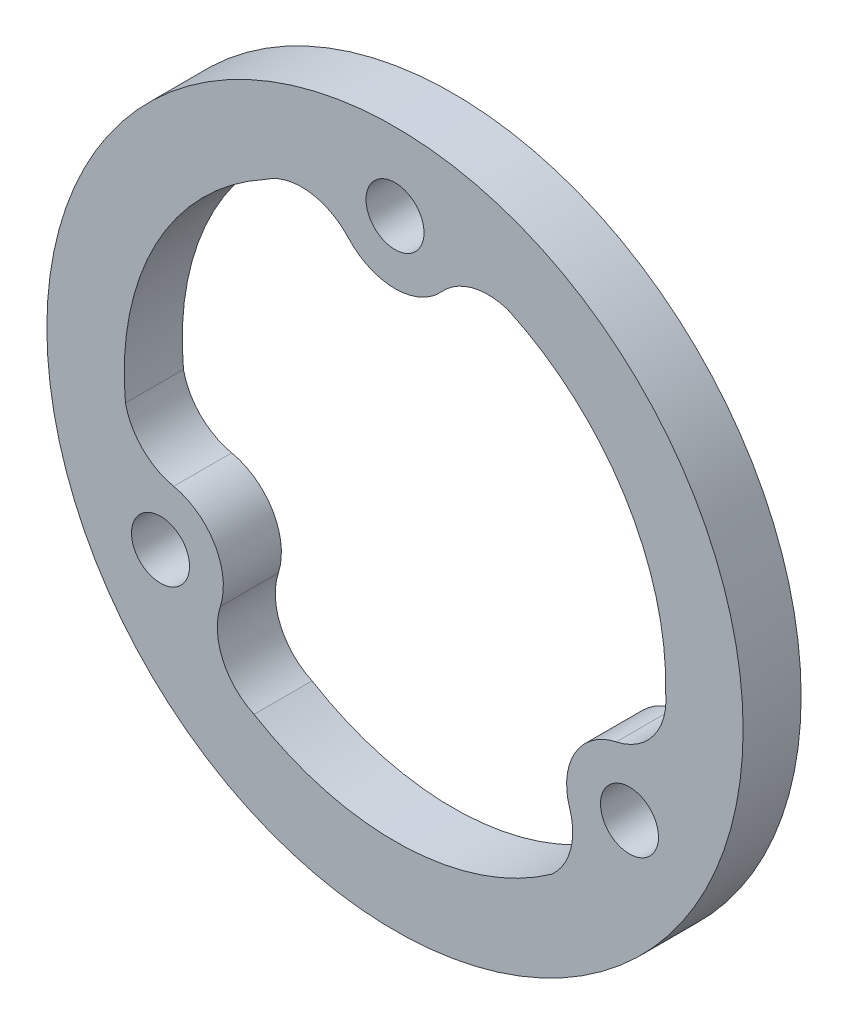
ISO-10303-21;
HEADER;
FILE_DESCRIPTION(('STEP AP214'),'2;1');
FILE_NAME('part.step','',(''),(''),'','','');
FILE_SCHEMA(('AUTOMOTIVE_DESIGN { 1 0 10303 214 1 1 1 1 }'));
ENDSEC;
DATA;
#1=APPLICATION_CONTEXT('core data for automotive mechanical design processes');
#2=APPLICATION_PROTOCOL_DEFINITION('international standard','automotive_design',2000,#1);
#3=PRODUCT_CONTEXT('',#1,'mechanical');
#4=PRODUCT('Part','Part','',(#3));
#5=PRODUCT_RELATED_PRODUCT_CATEGORY('part','',(#4));
#6=PRODUCT_DEFINITION_FORMATION('','',#4);
#7=PRODUCT_DEFINITION_CONTEXT('part definition',#1,'design');
#8=PRODUCT_DEFINITION('design','',#6,#7);
#9=PRODUCT_DEFINITION_SHAPE('','',#8);
#10=(LENGTH_UNIT() NAMED_UNIT(*) SI_UNIT(.MILLI.,.METRE.));
#11=(NAMED_UNIT(*) PLANE_ANGLE_UNIT() SI_UNIT($,.RADIAN.));
#12=(NAMED_UNIT(*) SI_UNIT($,.STERADIAN.) SOLID_ANGLE_UNIT());
#13=UNCERTAINTY_MEASURE_WITH_UNIT(LENGTH_MEASURE(1.E-05),#10,'distance_accuracy_value','');
#14=(GEOMETRIC_REPRESENTATION_CONTEXT(3) GLOBAL_UNCERTAINTY_ASSIGNED_CONTEXT((#13)) GLOBAL_UNIT_ASSIGNED_CONTEXT((#10,
#11,#12)) REPRESENTATION_CONTEXT('',''));
#15=CARTESIAN_POINT('',(0.,0.,0.));
#16=DIRECTION('',(0.,0.,1.));
#17=DIRECTION('',(1.,0.,0.));
#18=AXIS2_PLACEMENT_3D('',#15,#16,#17);
#19=CARTESIAN_POINT('',(0.,0.,3.));
#20=DIRECTION('',(0.,0.,1.));
#21=DIRECTION('',(1.,0.,0.));
#22=AXIS2_PLACEMENT_3D('',#19,#20,#21);
#23=PLANE('',#22);
#24=CARTESIAN_POINT('',(0.,0.,3.));
#25=DIRECTION('',(0.,0.,1.));
#26=DIRECTION('',(1.,0.,0.));
#27=AXIS2_PLACEMENT_3D('',#24,#25,#26);
#28=CIRCLE('',#27,14.);
#29=CARTESIAN_POINT('',(13.9959775932849,-0.335575935174573,3.));
#30=VERTEX_POINT('',#29);
#31=CARTESIAN_POINT('',(5.80943087987062,12.7377593340432,3.));
#32=VERTEX_POINT('',#31);
#33=EDGE_CURVE('E130',#30,#32,#28,.T.);
#34=ORIENTED_EDGE('',*,*,#33,.F.);
#35=CARTESIAN_POINT('',(10.7607074751454,-0.644650784804921,3.));
#36=DIRECTION('',(0.,0.,1.));
#37=DIRECTION('',(1.,0.,0.));
#38=AXIS2_PLACEMENT_3D('',#35,#36,#37);
#39=CIRCLE('',#38,3.25);
#40=CARTESIAN_POINT('',(11.4425315640637,-3.82232539240255,3.));
#41=VERTEX_POINT('',#40);
#42=EDGE_CURVE('E122',#41,#30,#39,.T.);
#43=ORIENTED_EDGE('',*,*,#42,.F.);
#44=CARTESIAN_POINT('',(12.124355652982,-7.00000000000017,3.));
#45=DIRECTION('',(0.,0.,-1.));
#46=DIRECTION('',(1.,0.,0.));
#47=AXIS2_PLACEMENT_3D('',#44,#45,#46);
#48=CIRCLE('',#47,3.25);
#49=CARTESIAN_POINT('',(9.03149667338257,-7.99836032188346,3.));
#50=VERTEX_POINT('',#49);
#51=EDGE_CURVE('E165',#50,#41,#48,.T.);
#52=ORIENTED_EDGE('',*,*,#51,.F.);
#53=CARTESIAN_POINT('',(5.93863769378309,-8.99672064376674,3.));
#54=DIRECTION('',(0.,0.,1.));
#55=DIRECTION('',(1.,0.,0.));
#56=AXIS2_PLACEMENT_3D('',#53,#54,#55);
#57=CIRCLE('',#56,3.25);
#58=CARTESIAN_POINT('',(8.12650773063849,-11.3999943905194,3.));
#59=VERTEX_POINT('',#58);
#60=EDGE_CURVE('E163',#59,#50,#57,.T.);
#61=ORIENTED_EDGE('',*,*,#60,.F.);
#62=CARTESIAN_POINT('',(0.,0.,3.));
#63=DIRECTION('',(0.,0.,1.));
#64=DIRECTION('',(1.,0.,0.));
#65=AXIS2_PLACEMENT_3D('',#62,#63,#64);
#66=CIRCLE('',#65,14.);
#67=CARTESIAN_POINT('',(-7.28860608140232,-11.9530841789952,3.));
#68=VERTEX_POINT('',#67);
#69=EDGE_CURVE('E161',#68,#59,#66,.T.);
#70=ORIENTED_EDGE('',*,*,#69,.F.);
#71=CARTESIAN_POINT('',(-5.93863769378334,-8.99672064376658,3.));
#72=DIRECTION('',(0.,0.,1.));
#73=DIRECTION('',(1.,0.,0.));
#74=AXIS2_PLACEMENT_3D('',#71,#72,#73);
#75=CIRCLE('',#74,3.25);
#76=CARTESIAN_POINT('',(-9.03149667338279,-7.9983603218832,3.));
#77=VERTEX_POINT('',#76);
#78=EDGE_CURVE('E159',#77,#68,#75,.T.);
#79=ORIENTED_EDGE('',*,*,#78,.F.);
#80=CARTESIAN_POINT('',(-12.1243556529822,-6.99999999999983,3.));
#81=DIRECTION('',(0.,0.,-1.));
#82=DIRECTION('',(1.,0.,0.));
#83=AXIS2_PLACEMENT_3D('',#80,#81,#82);
#84=CIRCLE('',#83,3.25);
#85=CARTESIAN_POINT('',(-11.4425315640638,-3.82232539240223,3.));
#86=VERTEX_POINT('',#85);
#87=EDGE_CURVE('E157',#86,#77,#84,.T.);
#88=ORIENTED_EDGE('',*,*,#87,.F.);
#89=CARTESIAN_POINT('',(-10.7607074751454,-0.644650784804622,3.));
#90=DIRECTION('',(0.,0.,1.));
#91=DIRECTION('',(1.,0.,0.));
#92=AXIS2_PLACEMENT_3D('',#89,#90,#91);
#93=CIRCLE('',#92,3.25);
#94=CARTESIAN_POINT('',(-13.9359386105091,-1.33776494352389,3.));
#95=VERTEX_POINT('',#94);
#96=EDGE_CURVE('E155',#95,#86,#93,.T.);
#97=ORIENTED_EDGE('',*,*,#96,.F.);
#98=CARTESIAN_POINT('',(0.,0.,3.));
#99=DIRECTION('',(0.,0.,1.));
#100=DIRECTION('',(1.,0.,0.));
#101=AXIS2_PLACEMENT_3D('',#98,#99,#100);
#102=CIRCLE('',#101,14.);
#103=CARTESIAN_POINT('',(-6.70737151188253,12.2886601141698,3.));
#104=VERTEX_POINT('',#103);
#105=EDGE_CURVE('E153',#104,#95,#102,.T.);
#106=ORIENTED_EDGE('',*,*,#105,.F.);
#107=CARTESIAN_POINT('',(-4.82206978136206,9.6413714285715,3.));
#108=DIRECTION('',(0.,0.,1.));
#109=DIRECTION('',(1.,0.,0.));
#110=AXIS2_PLACEMENT_3D('',#107,#108,#109);
#111=CIRCLE('',#110,3.25);
#112=CARTESIAN_POINT('',(-2.41103489068093,11.8206857142857,3.));
#113=VERTEX_POINT('',#112);
#114=EDGE_CURVE('E151',#113,#104,#111,.T.);
#115=ORIENTED_EDGE('',*,*,#114,.F.);
#116=CARTESIAN_POINT('',(2.01308400075598E-13,14.,3.));
#117=DIRECTION('',(0.,0.,-1.));
#118=DIRECTION('',(1.,0.,0.));
#119=AXIS2_PLACEMENT_3D('',#116,#117,#118);
#120=CIRCLE('',#119,3.25);
#121=CARTESIAN_POINT('',(2.41103489068127,11.8206857142857,3.));
#122=VERTEX_POINT('',#121);
#123=EDGE_CURVE('E146',#122,#113,#120,.T.);
#124=ORIENTED_EDGE('',*,*,#123,.F.);
#125=CARTESIAN_POINT('',(4.82206978136234,9.64137142857136,3.));
#126=DIRECTION('',(0.,0.,1.));
#127=DIRECTION('',(1.,0.,0.));
#128=AXIS2_PLACEMENT_3D('',#125,#126,#127);
#129=CIRCLE('',#128,3.25);
#130=EDGE_CURVE('E144',#32,#122,#129,.T.);
#131=ORIENTED_EDGE('',*,*,#130,.F.);
#132=EDGE_LOOP('',(#34,#43,#52,#61,#70,#79,#88,#97,#106,#115,#124,#131));
#133=FACE_BOUND('',#132,.T.);
#134=CARTESIAN_POINT('',(12.124355652982,-7.00000000000017,3.));
#135=DIRECTION('',(0.,0.,1.));
#136=DIRECTION('',(1.,0.,0.));
#137=AXIS2_PLACEMENT_3D('',#134,#135,#136);
#138=CIRCLE('',#137,1.50000000000007);
#139=CARTESIAN_POINT('',(13.6243556529821,-7.00000000000017,3.));
#140=VERTEX_POINT('',#139);
#141=EDGE_CURVE('E218',#140,#140,#138,.T.);
#142=ORIENTED_EDGE('',*,*,#141,.F.);
#143=EDGE_LOOP('',(#142));
#144=FACE_BOUND('',#143,.T.);
#145=CARTESIAN_POINT('',(0.,0.,3.));
#146=DIRECTION('',(0.,0.,1.));
#147=DIRECTION('',(1.,0.,0.));
#148=AXIS2_PLACEMENT_3D('',#145,#146,#147);
#149=CIRCLE('',#148,18.);
#150=CARTESIAN_POINT('',(18.,0.,3.));
#151=VERTEX_POINT('',#150);
#152=EDGE_CURVE('E11',#151,#151,#149,.T.);
#153=ORIENTED_EDGE('',*,*,#152,.T.);
#154=EDGE_LOOP('',(#153));
#155=FACE_BOUND('',#154,.T.);
#156=CARTESIAN_POINT('',(2.01308400075598E-13,14.,3.));
#157=DIRECTION('',(0.,0.,1.));
#158=DIRECTION('',(1.,0.,0.));
#159=AXIS2_PLACEMENT_3D('',#156,#157,#158);
#160=CIRCLE('',#159,1.5);
#161=CARTESIAN_POINT('',(1.5000000000002,14.,3.));
#162=VERTEX_POINT('',#161);
#163=EDGE_CURVE('E224',#162,#162,#160,.T.);
#164=ORIENTED_EDGE('',*,*,#163,.F.);
#165=EDGE_LOOP('',(#164));
#166=FACE_BOUND('',#165,.T.);
#167=CARTESIAN_POINT('',(-12.1243556529822,-6.99999999999983,3.));
#168=DIRECTION('',(0.,0.,1.));
#169=DIRECTION('',(1.,0.,0.));
#170=AXIS2_PLACEMENT_3D('',#167,#168,#169);
#171=CIRCLE('',#170,1.5);
#172=CARTESIAN_POINT('',(-10.6243556529822,-6.99999999999983,3.));
#173=VERTEX_POINT('',#172);
#174=EDGE_CURVE('E168',#173,#173,#171,.T.);
#175=ORIENTED_EDGE('',*,*,#174,.F.);
#176=EDGE_LOOP('',(#175));
#177=FACE_BOUND('',#176,.T.);
#178=ADVANCED_FACE('F33',(#133,#144,#155,#166,#177),#23,.T.);
#179=CARTESIAN_POINT('',(0.,0.,0.));
#180=DIRECTION('',(0.,0.,1.));
#181=DIRECTION('',(1.,0.,0.));
#182=AXIS2_PLACEMENT_3D('',#179,#180,#181);
#183=PLANE('',#182);
#184=CARTESIAN_POINT('',(12.124355652982,-7.00000000000017,0.));
#185=DIRECTION('',(0.,0.,1.));
#186=DIRECTION('',(1.,0.,0.));
#187=AXIS2_PLACEMENT_3D('',#184,#185,#186);
#188=CIRCLE('',#187,1.50000000000007);
#189=CARTESIAN_POINT('',(13.6243556529821,-7.00000000000017,0.));
#190=VERTEX_POINT('',#189);
#191=EDGE_CURVE('E138',#190,#190,#188,.T.);
#192=ORIENTED_EDGE('',*,*,#191,.T.);
#193=EDGE_LOOP('',(#192));
#194=FACE_BOUND('',#193,.T.);
#195=CARTESIAN_POINT('',(2.01308400075598E-13,14.,0.));
#196=DIRECTION('',(0.,0.,1.));
#197=DIRECTION('',(1.,0.,0.));
#198=AXIS2_PLACEMENT_3D('',#195,#196,#197);
#199=CIRCLE('',#198,1.5);
#200=CARTESIAN_POINT('',(1.5000000000002,14.,0.));
#201=VERTEX_POINT('',#200);
#202=EDGE_CURVE('E221',#201,#201,#199,.T.);
#203=ORIENTED_EDGE('',*,*,#202,.T.);
#204=EDGE_LOOP('',(#203));
#205=FACE_BOUND('',#204,.T.);
#206=CARTESIAN_POINT('',(0.,0.,0.));
#207=DIRECTION('',(0.,0.,1.));
#208=DIRECTION('',(1.,0.,0.));
#209=AXIS2_PLACEMENT_3D('',#206,#207,#208);
#210=CIRCLE('',#209,18.);
#211=CARTESIAN_POINT('',(18.,0.,0.));
#212=VERTEX_POINT('',#211);
#213=EDGE_CURVE('E37',#212,#212,#210,.T.);
#214=ORIENTED_EDGE('',*,*,#213,.F.);
#215=EDGE_LOOP('',(#214));
#216=FACE_BOUND('',#215,.T.);
#217=CARTESIAN_POINT('',(10.7607074751454,-0.644650784804921,0.));
#218=DIRECTION('',(0.,0.,1.));
#219=DIRECTION('',(1.,0.,0.));
#220=AXIS2_PLACEMENT_3D('',#217,#218,#219);
#221=CIRCLE('',#220,3.25);
#222=CARTESIAN_POINT('',(11.4425315640637,-3.82232539240255,0.));
#223=VERTEX_POINT('',#222);
#224=CARTESIAN_POINT('',(13.9959775932849,-0.335575935174573,0.));
#225=VERTEX_POINT('',#224);
#226=EDGE_CURVE('E56',#223,#225,#221,.T.);
#227=ORIENTED_EDGE('',*,*,#226,.T.);
#228=CARTESIAN_POINT('',(0.,0.,0.));
#229=DIRECTION('',(0.,0.,1.));
#230=DIRECTION('',(1.,0.,0.));
#231=AXIS2_PLACEMENT_3D('',#228,#229,#230);
#232=CIRCLE('',#231,14.);
#233=CARTESIAN_POINT('',(5.80943087987062,12.7377593340432,0.));
#234=VERTEX_POINT('',#233);
#235=EDGE_CURVE('E137',#225,#234,#232,.T.);
#236=ORIENTED_EDGE('',*,*,#235,.T.);
#237=CARTESIAN_POINT('',(4.82206978136234,9.64137142857136,0.));
#238=DIRECTION('',(0.,0.,1.));
#239=DIRECTION('',(1.,0.,0.));
#240=AXIS2_PLACEMENT_3D('',#237,#238,#239);
#241=CIRCLE('',#240,3.25);
#242=CARTESIAN_POINT('',(2.41103489068127,11.8206857142857,0.));
#243=VERTEX_POINT('',#242);
#244=EDGE_CURVE('E170',#234,#243,#241,.T.);
#245=ORIENTED_EDGE('',*,*,#244,.T.);
#246=CARTESIAN_POINT('',(2.01308400075598E-13,14.,0.));
#247=DIRECTION('',(0.,0.,-1.));
#248=DIRECTION('',(1.,0.,0.));
#249=AXIS2_PLACEMENT_3D('',#246,#247,#248);
#250=CIRCLE('',#249,3.25);
#251=CARTESIAN_POINT('',(-2.41103489068093,11.8206857142857,0.));
#252=VERTEX_POINT('',#251);
#253=EDGE_CURVE('E173',#243,#252,#250,.T.);
#254=ORIENTED_EDGE('',*,*,#253,.T.);
#255=CARTESIAN_POINT('',(-4.82206978136206,9.6413714285715,0.));
#256=DIRECTION('',(0.,0.,1.));
#257=DIRECTION('',(1.,0.,0.));
#258=AXIS2_PLACEMENT_3D('',#255,#256,#257);
#259=CIRCLE('',#258,3.25);
#260=CARTESIAN_POINT('',(-6.70737151188253,12.2886601141698,0.));
#261=VERTEX_POINT('',#260);
#262=EDGE_CURVE('E176',#252,#261,#259,.T.);
#263=ORIENTED_EDGE('',*,*,#262,.T.);
#264=CARTESIAN_POINT('',(0.,0.,0.));
#265=DIRECTION('',(0.,0.,1.));
#266=DIRECTION('',(1.,0.,0.));
#267=AXIS2_PLACEMENT_3D('',#264,#265,#266);
#268=CIRCLE('',#267,14.);
#269=CARTESIAN_POINT('',(-13.9359386105091,-1.33776494352389,0.));
#270=VERTEX_POINT('',#269);
#271=EDGE_CURVE('E179',#261,#270,#268,.T.);
#272=ORIENTED_EDGE('',*,*,#271,.T.);
#273=CARTESIAN_POINT('',(-10.7607074751454,-0.644650784804622,0.));
#274=DIRECTION('',(0.,0.,1.));
#275=DIRECTION('',(1.,0.,0.));
#276=AXIS2_PLACEMENT_3D('',#273,#274,#275);
#277=CIRCLE('',#276,3.25);
#278=CARTESIAN_POINT('',(-11.4425315640638,-3.82232539240223,0.));
#279=VERTEX_POINT('',#278);
#280=EDGE_CURVE('E182',#270,#279,#277,.T.);
#281=ORIENTED_EDGE('',*,*,#280,.T.);
#282=CARTESIAN_POINT('',(-12.1243556529822,-6.99999999999983,0.));
#283=DIRECTION('',(0.,0.,-1.));
#284=DIRECTION('',(1.,0.,0.));
#285=AXIS2_PLACEMENT_3D('',#282,#283,#284);
#286=CIRCLE('',#285,3.25);
#287=CARTESIAN_POINT('',(-9.03149667338279,-7.9983603218832,0.));
#288=VERTEX_POINT('',#287);
#289=EDGE_CURVE('E185',#279,#288,#286,.T.);
#290=ORIENTED_EDGE('',*,*,#289,.T.);
#291=CARTESIAN_POINT('',(-5.93863769378334,-8.99672064376658,0.));
#292=DIRECTION('',(0.,0.,1.));
#293=DIRECTION('',(1.,0.,0.));
#294=AXIS2_PLACEMENT_3D('',#291,#292,#293);
#295=CIRCLE('',#294,3.25);
#296=CARTESIAN_POINT('',(-7.28860608140232,-11.9530841789952,0.));
#297=VERTEX_POINT('',#296);
#298=EDGE_CURVE('E188',#288,#297,#295,.T.);
#299=ORIENTED_EDGE('',*,*,#298,.T.);
#300=CARTESIAN_POINT('',(0.,0.,0.));
#301=DIRECTION('',(0.,0.,1.));
#302=DIRECTION('',(1.,0.,0.));
#303=AXIS2_PLACEMENT_3D('',#300,#301,#302);
#304=CIRCLE('',#303,14.);
#305=CARTESIAN_POINT('',(8.12650773063849,-11.3999943905194,0.));
#306=VERTEX_POINT('',#305);
#307=EDGE_CURVE('E191',#297,#306,#304,.T.);
#308=ORIENTED_EDGE('',*,*,#307,.T.);
#309=CARTESIAN_POINT('',(5.93863769378309,-8.99672064376674,0.));
#310=DIRECTION('',(0.,0.,1.));
#311=DIRECTION('',(1.,0.,0.));
#312=AXIS2_PLACEMENT_3D('',#309,#310,#311);
#313=CIRCLE('',#312,3.25);
#314=CARTESIAN_POINT('',(9.03149667338257,-7.99836032188346,0.));
#315=VERTEX_POINT('',#314);
#316=EDGE_CURVE('E194',#306,#315,#313,.T.);
#317=ORIENTED_EDGE('',*,*,#316,.T.);
#318=CARTESIAN_POINT('',(12.124355652982,-7.00000000000017,0.));
#319=DIRECTION('',(0.,0.,-1.));
#320=DIRECTION('',(1.,0.,0.));
#321=AXIS2_PLACEMENT_3D('',#318,#319,#320);
#322=CIRCLE('',#321,3.25);
#323=EDGE_CURVE('E131',#315,#223,#322,.T.);
#324=ORIENTED_EDGE('',*,*,#323,.T.);
#325=EDGE_LOOP('',(#227,#236,#245,#254,#263,#272,#281,#290,#299,#308,#317,#324));
#326=FACE_BOUND('',#325,.T.);
#327=CARTESIAN_POINT('',(-12.1243556529822,-6.99999999999983,0.));
#328=DIRECTION('',(0.,0.,1.));
#329=DIRECTION('',(1.,0.,0.));
#330=AXIS2_PLACEMENT_3D('',#327,#328,#329);
#331=CIRCLE('',#330,1.5);
#332=CARTESIAN_POINT('',(-10.6243556529822,-6.99999999999983,0.));
#333=VERTEX_POINT('',#332);
#334=EDGE_CURVE('E403',#333,#333,#331,.T.);
#335=ORIENTED_EDGE('',*,*,#334,.T.);
#336=EDGE_LOOP('',(#335));
#337=FACE_BOUND('',#336,.T.);
#338=ADVANCED_FACE('F230',(#194,#205,#216,#326,#337),#183,.F.);
#339=CARTESIAN_POINT('',(0.,0.,3.));
#340=DIRECTION('',(0.,0.,-1.));
#341=DIRECTION('',(-1.,0.,0.));
#342=AXIS2_PLACEMENT_3D('',#339,#340,#341);
#343=CYLINDRICAL_SURFACE('',#342,18.);
#344=ORIENTED_EDGE('',*,*,#152,.F.);
#345=EDGE_LOOP('',(#344));
#346=FACE_BOUND('',#345,.T.);
#347=ORIENTED_EDGE('',*,*,#213,.T.);
#348=EDGE_LOOP('',(#347));
#349=FACE_BOUND('',#348,.T.);
#350=ADVANCED_FACE('F35',(#346,#349),#343,.T.);
#351=CARTESIAN_POINT('',(2.01308400075598E-13,14.,3.));
#352=DIRECTION('',(0.,0.,-1.));
#353=DIRECTION('',(-1.,0.,0.));
#354=AXIS2_PLACEMENT_3D('',#351,#352,#353);
#355=CYLINDRICAL_SURFACE('',#354,1.5);
#356=ORIENTED_EDGE('',*,*,#163,.T.);
#357=EDGE_LOOP('',(#356));
#358=FACE_BOUND('',#357,.T.);
#359=ORIENTED_EDGE('',*,*,#202,.F.);
#360=EDGE_LOOP('',(#359));
#361=FACE_BOUND('',#360,.T.);
#362=ADVANCED_FACE('F233',(#358,#361),#355,.F.);
#363=CARTESIAN_POINT('',(12.124355652982,-7.00000000000017,3.));
#364=DIRECTION('',(0.,0.,-1.));
#365=DIRECTION('',(-1.,0.,0.));
#366=AXIS2_PLACEMENT_3D('',#363,#364,#365);
#367=CYLINDRICAL_SURFACE('',#366,1.50000000000007);
#368=ORIENTED_EDGE('',*,*,#141,.T.);
#369=EDGE_LOOP('',(#368));
#370=FACE_BOUND('',#369,.T.);
#371=ORIENTED_EDGE('',*,*,#191,.F.);
#372=EDGE_LOOP('',(#371));
#373=FACE_BOUND('',#372,.T.);
#374=ADVANCED_FACE('F235',(#370,#373),#367,.F.);
#375=CARTESIAN_POINT('',(10.7607074751454,-0.644650784804921,3.));
#376=DIRECTION('',(0.,0.,-1.));
#377=DIRECTION('',(-1.,0.,0.));
#378=AXIS2_PLACEMENT_3D('',#375,#376,#377);
#379=CYLINDRICAL_SURFACE('',#378,3.25);
#380=ORIENTED_EDGE('',*,*,#226,.F.);
#381=DIRECTION('',(0.,0.,-1.));
#382=VECTOR('',#381,1.);
#383=CARTESIAN_POINT('',(11.4425315640637,-3.82232539240255,3.));
#384=LINE('',#383,#382);
#385=EDGE_CURVE('E126',#41,#223,#384,.T.);
#386=ORIENTED_EDGE('',*,*,#385,.F.);
#387=ORIENTED_EDGE('',*,*,#42,.T.);
#388=DIRECTION('',(0.,0.,-1.));
#389=VECTOR('',#388,1.);
#390=CARTESIAN_POINT('',(13.9959775932849,-0.335575935174573,3.));
#391=LINE('',#390,#389);
#392=EDGE_CURVE('E125',#30,#225,#391,.T.);
#393=ORIENTED_EDGE('',*,*,#392,.T.);
#394=EDGE_LOOP('',(#380,#386,#387,#393));
#395=FACE_BOUND('',#394,.T.);
#396=ADVANCED_FACE('F124',(#395),#379,.F.);
#397=CARTESIAN_POINT('',(0.,0.,3.));
#398=DIRECTION('',(0.,0.,-1.));
#399=DIRECTION('',(-1.,0.,0.));
#400=AXIS2_PLACEMENT_3D('',#397,#398,#399);
#401=CYLINDRICAL_SURFACE('',#400,14.);
#402=ORIENTED_EDGE('',*,*,#235,.F.);
#403=ORIENTED_EDGE('',*,*,#392,.F.);
#404=ORIENTED_EDGE('',*,*,#33,.T.);
#405=DIRECTION('',(0.,0.,-1.));
#406=VECTOR('',#405,1.);
#407=CARTESIAN_POINT('',(5.80943087987062,12.7377593340432,3.));
#408=LINE('',#407,#406);
#409=EDGE_CURVE('E139',#32,#234,#408,.T.);
#410=ORIENTED_EDGE('',*,*,#409,.T.);
#411=EDGE_LOOP('',(#402,#403,#404,#410));
#412=FACE_BOUND('',#411,.T.);
#413=ADVANCED_FACE('F134',(#412),#401,.F.);
#414=CARTESIAN_POINT('',(4.82206978136234,9.64137142857136,3.));
#415=DIRECTION('',(0.,0.,-1.));
#416=DIRECTION('',(-1.,0.,0.));
#417=AXIS2_PLACEMENT_3D('',#414,#415,#416);
#418=CYLINDRICAL_SURFACE('',#417,3.25);
#419=ORIENTED_EDGE('',*,*,#244,.F.);
#420=ORIENTED_EDGE('',*,*,#409,.F.);
#421=ORIENTED_EDGE('',*,*,#130,.T.);
#422=DIRECTION('',(0.,0.,-1.));
#423=VECTOR('',#422,1.);
#424=CARTESIAN_POINT('',(2.41103489068127,11.8206857142857,3.));
#425=LINE('',#424,#423);
#426=EDGE_CURVE('E215',#122,#243,#425,.T.);
#427=ORIENTED_EDGE('',*,*,#426,.T.);
#428=EDGE_LOOP('',(#419,#420,#421,#427));
#429=FACE_BOUND('',#428,.T.);
#430=ADVANCED_FACE('F286',(#429),#418,.F.);
#431=CARTESIAN_POINT('',(2.01308400075598E-13,14.,3.));
#432=DIRECTION('',(0.,0.,-1.));
#433=DIRECTION('',(-1.,0.,0.));
#434=AXIS2_PLACEMENT_3D('',#431,#432,#433);
#435=CYLINDRICAL_SURFACE('',#434,3.25);
#436=ORIENTED_EDGE('',*,*,#253,.F.);
#437=ORIENTED_EDGE('',*,*,#426,.F.);
#438=ORIENTED_EDGE('',*,*,#123,.T.);
#439=DIRECTION('',(0.,0.,-1.));
#440=VECTOR('',#439,1.);
#441=CARTESIAN_POINT('',(-2.41103489068093,11.8206857142857,3.));
#442=LINE('',#441,#440);
#443=EDGE_CURVE('E213',#113,#252,#442,.T.);
#444=ORIENTED_EDGE('',*,*,#443,.T.);
#445=EDGE_LOOP('',(#436,#437,#438,#444));
#446=FACE_BOUND('',#445,.T.);
#447=ADVANCED_FACE('F295',(#446),#435,.T.);
#448=CARTESIAN_POINT('',(-4.82206978136206,9.6413714285715,3.));
#449=DIRECTION('',(0.,0.,-1.));
#450=DIRECTION('',(-1.,0.,0.));
#451=AXIS2_PLACEMENT_3D('',#448,#449,#450);
#452=CYLINDRICAL_SURFACE('',#451,3.25);
#453=ORIENTED_EDGE('',*,*,#262,.F.);
#454=ORIENTED_EDGE('',*,*,#443,.F.);
#455=ORIENTED_EDGE('',*,*,#114,.T.);
#456=DIRECTION('',(0.,0.,-1.));
#457=VECTOR('',#456,1.);
#458=CARTESIAN_POINT('',(-6.70737151188253,12.2886601141698,3.));
#459=LINE('',#458,#457);
#460=EDGE_CURVE('E211',#104,#261,#459,.T.);
#461=ORIENTED_EDGE('',*,*,#460,.T.);
#462=EDGE_LOOP('',(#453,#454,#455,#461));
#463=FACE_BOUND('',#462,.T.);
#464=ADVANCED_FACE('F305',(#463),#452,.F.);
#465=CARTESIAN_POINT('',(0.,0.,3.));
#466=DIRECTION('',(0.,0.,-1.));
#467=DIRECTION('',(-1.,0.,0.));
#468=AXIS2_PLACEMENT_3D('',#465,#466,#467);
#469=CYLINDRICAL_SURFACE('',#468,14.);
#470=ORIENTED_EDGE('',*,*,#271,.F.);
#471=ORIENTED_EDGE('',*,*,#460,.F.);
#472=ORIENTED_EDGE('',*,*,#105,.T.);
#473=DIRECTION('',(0.,0.,-1.));
#474=VECTOR('',#473,1.);
#475=CARTESIAN_POINT('',(-13.9359386105091,-1.33776494352389,3.));
#476=LINE('',#475,#474);
#477=EDGE_CURVE('E209',#95,#270,#476,.T.);
#478=ORIENTED_EDGE('',*,*,#477,.T.);
#479=EDGE_LOOP('',(#470,#471,#472,#478));
#480=FACE_BOUND('',#479,.T.);
#481=ADVANCED_FACE('F315',(#480),#469,.F.);
#482=CARTESIAN_POINT('',(-10.7607074751454,-0.644650784804622,3.));
#483=DIRECTION('',(0.,0.,-1.));
#484=DIRECTION('',(-1.,0.,0.));
#485=AXIS2_PLACEMENT_3D('',#482,#483,#484);
#486=CYLINDRICAL_SURFACE('',#485,3.25);
#487=ORIENTED_EDGE('',*,*,#280,.F.);
#488=ORIENTED_EDGE('',*,*,#477,.F.);
#489=ORIENTED_EDGE('',*,*,#96,.T.);
#490=DIRECTION('',(0.,0.,-1.));
#491=VECTOR('',#490,1.);
#492=CARTESIAN_POINT('',(-11.4425315640638,-3.82232539240223,3.));
#493=LINE('',#492,#491);
#494=EDGE_CURVE('E207',#86,#279,#493,.T.);
#495=ORIENTED_EDGE('',*,*,#494,.T.);
#496=EDGE_LOOP('',(#487,#488,#489,#495));
#497=FACE_BOUND('',#496,.T.);
#498=ADVANCED_FACE('F325',(#497),#486,.F.);
#499=CARTESIAN_POINT('',(-12.1243556529822,-6.99999999999983,3.));
#500=DIRECTION('',(0.,0.,-1.));
#501=DIRECTION('',(-1.,0.,0.));
#502=AXIS2_PLACEMENT_3D('',#499,#500,#501);
#503=CYLINDRICAL_SURFACE('',#502,3.25);
#504=ORIENTED_EDGE('',*,*,#289,.F.);
#505=ORIENTED_EDGE('',*,*,#494,.F.);
#506=ORIENTED_EDGE('',*,*,#87,.T.);
#507=DIRECTION('',(0.,0.,-1.));
#508=VECTOR('',#507,1.);
#509=CARTESIAN_POINT('',(-9.03149667338279,-7.9983603218832,3.));
#510=LINE('',#509,#508);
#511=EDGE_CURVE('E205',#77,#288,#510,.T.);
#512=ORIENTED_EDGE('',*,*,#511,.T.);
#513=EDGE_LOOP('',(#504,#505,#506,#512));
#514=FACE_BOUND('',#513,.T.);
#515=ADVANCED_FACE('F335',(#514),#503,.T.);
#516=CARTESIAN_POINT('',(-5.93863769378334,-8.99672064376658,3.));
#517=DIRECTION('',(0.,0.,-1.));
#518=DIRECTION('',(-1.,0.,0.));
#519=AXIS2_PLACEMENT_3D('',#516,#517,#518);
#520=CYLINDRICAL_SURFACE('',#519,3.25);
#521=ORIENTED_EDGE('',*,*,#298,.F.);
#522=ORIENTED_EDGE('',*,*,#511,.F.);
#523=ORIENTED_EDGE('',*,*,#78,.T.);
#524=DIRECTION('',(0.,0.,-1.));
#525=VECTOR('',#524,1.);
#526=CARTESIAN_POINT('',(-7.28860608140232,-11.9530841789952,3.));
#527=LINE('',#526,#525);
#528=EDGE_CURVE('E203',#68,#297,#527,.T.);
#529=ORIENTED_EDGE('',*,*,#528,.T.);
#530=EDGE_LOOP('',(#521,#522,#523,#529));
#531=FACE_BOUND('',#530,.T.);
#532=ADVANCED_FACE('F345',(#531),#520,.F.);
#533=CARTESIAN_POINT('',(0.,0.,3.));
#534=DIRECTION('',(0.,0.,-1.));
#535=DIRECTION('',(-1.,0.,0.));
#536=AXIS2_PLACEMENT_3D('',#533,#534,#535);
#537=CYLINDRICAL_SURFACE('',#536,14.);
#538=ORIENTED_EDGE('',*,*,#307,.F.);
#539=ORIENTED_EDGE('',*,*,#528,.F.);
#540=ORIENTED_EDGE('',*,*,#69,.T.);
#541=DIRECTION('',(0.,0.,-1.));
#542=VECTOR('',#541,1.);
#543=CARTESIAN_POINT('',(8.12650773063849,-11.3999943905194,3.));
#544=LINE('',#543,#542);
#545=EDGE_CURVE('E201',#59,#306,#544,.T.);
#546=ORIENTED_EDGE('',*,*,#545,.T.);
#547=EDGE_LOOP('',(#538,#539,#540,#546));
#548=FACE_BOUND('',#547,.T.);
#549=ADVANCED_FACE('F355',(#548),#537,.F.);
#550=CARTESIAN_POINT('',(5.93863769378309,-8.99672064376674,3.));
#551=DIRECTION('',(0.,0.,-1.));
#552=DIRECTION('',(-1.,0.,0.));
#553=AXIS2_PLACEMENT_3D('',#550,#551,#552);
#554=CYLINDRICAL_SURFACE('',#553,3.25);
#555=ORIENTED_EDGE('',*,*,#316,.F.);
#556=ORIENTED_EDGE('',*,*,#545,.F.);
#557=ORIENTED_EDGE('',*,*,#60,.T.);
#558=DIRECTION('',(0.,0.,-1.));
#559=VECTOR('',#558,1.);
#560=CARTESIAN_POINT('',(9.03149667338257,-7.99836032188346,3.));
#561=LINE('',#560,#559);
#562=EDGE_CURVE('E48',#50,#315,#561,.T.);
#563=ORIENTED_EDGE('',*,*,#562,.T.);
#564=EDGE_LOOP('',(#555,#556,#557,#563));
#565=FACE_BOUND('',#564,.T.);
#566=ADVANCED_FACE('F365',(#565),#554,.F.);
#567=CARTESIAN_POINT('',(12.124355652982,-7.00000000000017,3.));
#568=DIRECTION('',(0.,0.,-1.));
#569=DIRECTION('',(-1.,0.,0.));
#570=AXIS2_PLACEMENT_3D('',#567,#568,#569);
#571=CYLINDRICAL_SURFACE('',#570,3.25);
#572=ORIENTED_EDGE('',*,*,#323,.F.);
#573=ORIENTED_EDGE('',*,*,#562,.F.);
#574=ORIENTED_EDGE('',*,*,#51,.T.);
#575=ORIENTED_EDGE('',*,*,#385,.T.);
#576=EDGE_LOOP('',(#572,#573,#574,#575));
#577=FACE_BOUND('',#576,.T.);
#578=ADVANCED_FACE('F375',(#577),#571,.T.);
#579=CARTESIAN_POINT('',(-12.1243556529822,-6.99999999999983,3.));
#580=DIRECTION('',(0.,0.,-1.));
#581=DIRECTION('',(-1.,0.,0.));
#582=AXIS2_PLACEMENT_3D('',#579,#580,#581);
#583=CYLINDRICAL_SURFACE('',#582,1.5);
#584=ORIENTED_EDGE('',*,*,#174,.T.);
#585=EDGE_LOOP('',(#584));
#586=FACE_BOUND('',#585,.T.);
#587=ORIENTED_EDGE('',*,*,#334,.F.);
#588=EDGE_LOOP('',(#587));
#589=FACE_BOUND('',#588,.T.);
#590=ADVANCED_FACE('F385',(#586,#589),#583,.F.);
#591=CLOSED_SHELL('',(#178,#338,#350,#362,#374,#396,#413,#430,#447,#464,#481,#498,#515,#532,
#549,#566,#578,#590));
#592=MANIFOLD_SOLID_BREP('B2',#591);
#593=ADVANCED_BREP_SHAPE_REPRESENTATION('',(#18,#592),#14);
#594=SHAPE_DEFINITION_REPRESENTATION(#9,#593);
ENDSEC;
END-ISO-10303-21;
